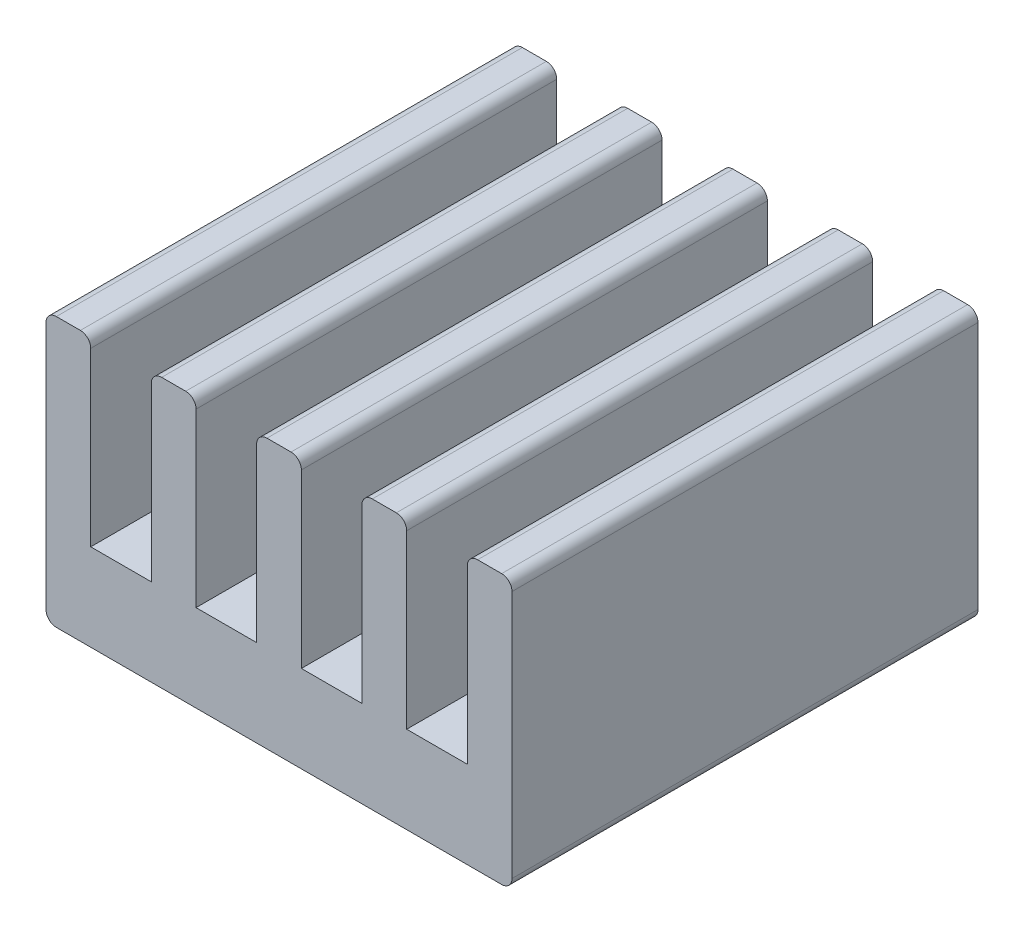
ISO-10303-21;
HEADER;
FILE_DESCRIPTION(('STEP AP214'),'2;1');
FILE_NAME('part.step','',(''),(''),'','','');
FILE_SCHEMA(('AUTOMOTIVE_DESIGN { 1 0 10303 214 1 1 1 1 }'));
ENDSEC;
DATA;
#1=APPLICATION_CONTEXT('core data for automotive mechanical design processes');
#2=APPLICATION_PROTOCOL_DEFINITION('international standard','automotive_design',2000,#1);
#3=PRODUCT_CONTEXT('',#1,'mechanical');
#4=PRODUCT('Part','Part','',(#3));
#5=PRODUCT_RELATED_PRODUCT_CATEGORY('part','',(#4));
#6=PRODUCT_DEFINITION_FORMATION('','',#4);
#7=PRODUCT_DEFINITION_CONTEXT('part definition',#1,'design');
#8=PRODUCT_DEFINITION('design','',#6,#7);
#9=PRODUCT_DEFINITION_SHAPE('','',#8);
#10=(LENGTH_UNIT() NAMED_UNIT(*) SI_UNIT(.MILLI.,.METRE.));
#11=(NAMED_UNIT(*) PLANE_ANGLE_UNIT() SI_UNIT($,.RADIAN.));
#12=(NAMED_UNIT(*) SI_UNIT($,.STERADIAN.) SOLID_ANGLE_UNIT());
#13=UNCERTAINTY_MEASURE_WITH_UNIT(LENGTH_MEASURE(1.E-05),#10,'distance_accuracy_value','');
#14=(GEOMETRIC_REPRESENTATION_CONTEXT(3) GLOBAL_UNCERTAINTY_ASSIGNED_CONTEXT((#13)) GLOBAL_UNIT_ASSIGNED_CONTEXT((#10,
#11,#12)) REPRESENTATION_CONTEXT('',''));
#15=CARTESIAN_POINT('',(0.,0.,0.));
#16=DIRECTION('',(0.,0.,1.));
#17=DIRECTION('',(1.,0.,0.));
#18=AXIS2_PLACEMENT_3D('',#15,#16,#17);
#19=CARTESIAN_POINT('',(0.,5.2,0.));
#20=DIRECTION('',(0.,-1.,0.));
#21=DIRECTION('',(0.,0.,-1.));
#22=AXIS2_PLACEMENT_3D('',#19,#20,#21);
#23=PLANE('',#22);
#24=DIRECTION('',(-1.,0.,0.));
#25=VECTOR('',#24,1.);
#26=CARTESIAN_POINT('',(-4.5,5.2,-4.5));
#27=LINE('',#26,#25);
#28=CARTESIAN_POINT('',(-1.802,5.2,-4.5));
#29=VERTEX_POINT('',#28);
#30=CARTESIAN_POINT('',(-2.266,5.2,-4.5));
#31=VERTEX_POINT('',#30);
#32=EDGE_CURVE('E347',#29,#31,#27,.T.);
#33=ORIENTED_EDGE('',*,*,#32,.T.);
#34=DIRECTION('',(0.,0.,1.));
#35=VECTOR('',#34,1.);
#36=CARTESIAN_POINT('',(-2.266,5.2,0.));
#37=LINE('',#36,#35);
#38=CARTESIAN_POINT('',(-2.266,5.2,4.5));
#39=VERTEX_POINT('',#38);
#40=EDGE_CURVE('E441',#31,#39,#37,.T.);
#41=ORIENTED_EDGE('',*,*,#40,.T.);
#42=DIRECTION('',(1.,0.,0.));
#43=VECTOR('',#42,1.);
#44=CARTESIAN_POINT('',(-4.5,5.2,4.5));
#45=LINE('',#44,#43);
#46=CARTESIAN_POINT('',(-1.802,5.2,4.5));
#47=VERTEX_POINT('',#46);
#48=EDGE_CURVE('E353',#39,#47,#45,.T.);
#49=ORIENTED_EDGE('',*,*,#48,.T.);
#50=DIRECTION('',(0.,0.,1.));
#51=VECTOR('',#50,1.);
#52=CARTESIAN_POINT('',(-1.802,5.2,0.));
#53=LINE('',#52,#51);
#54=EDGE_CURVE('E439',#47,#29,#53,.F.);
#55=ORIENTED_EDGE('',*,*,#54,.T.);
#56=EDGE_LOOP('',(#33,#41,#49,#55));
#57=FACE_BOUND('',#56,.T.);
#58=ADVANCED_FACE('F35',(#57),#23,.F.);
#59=CARTESIAN_POINT('',(2.266,5.2,-4.5));
#60=VERTEX_POINT('',#59);
#61=CARTESIAN_POINT('',(1.802,5.2,-4.5));
#62=VERTEX_POINT('',#61);
#63=EDGE_CURVE('E487',#60,#62,#27,.T.);
#64=ORIENTED_EDGE('',*,*,#63,.T.);
#65=DIRECTION('',(0.,0.,1.));
#66=VECTOR('',#65,1.);
#67=CARTESIAN_POINT('',(1.802,5.2,0.));
#68=LINE('',#67,#66);
#69=CARTESIAN_POINT('',(1.802,5.2,4.5));
#70=VERTEX_POINT('',#69);
#71=EDGE_CURVE('E459',#62,#70,#68,.T.);
#72=ORIENTED_EDGE('',*,*,#71,.T.);
#73=CARTESIAN_POINT('',(2.266,5.2,4.5));
#74=VERTEX_POINT('',#73);
#75=EDGE_CURVE('E354',#70,#74,#45,.T.);
#76=ORIENTED_EDGE('',*,*,#75,.T.);
#77=DIRECTION('',(0.,0.,1.));
#78=VECTOR('',#77,1.);
#79=CARTESIAN_POINT('',(2.266,5.2,0.));
#80=LINE('',#79,#78);
#81=EDGE_CURVE('E457',#74,#60,#80,.F.);
#82=ORIENTED_EDGE('',*,*,#81,.T.);
#83=EDGE_LOOP('',(#64,#72,#76,#82));
#84=FACE_BOUND('',#83,.T.);
#85=ADVANCED_FACE('F583',(#84),#23,.F.);
#86=CARTESIAN_POINT('',(0.232000000000002,5.2,-4.5));
#87=VERTEX_POINT('',#86);
#88=CARTESIAN_POINT('',(-0.231999999999999,5.2,-4.5));
#89=VERTEX_POINT('',#88);
#90=EDGE_CURVE('E511',#87,#89,#27,.T.);
#91=ORIENTED_EDGE('',*,*,#90,.T.);
#92=DIRECTION('',(0.,0.,1.));
#93=VECTOR('',#92,1.);
#94=CARTESIAN_POINT('',(-0.231999999999999,5.2,0.));
#95=LINE('',#94,#93);
#96=CARTESIAN_POINT('',(-0.231999999999999,5.2,4.5));
#97=VERTEX_POINT('',#96);
#98=EDGE_CURVE('E449',#89,#97,#95,.T.);
#99=ORIENTED_EDGE('',*,*,#98,.T.);
#100=CARTESIAN_POINT('',(0.232000000000002,5.2,4.5));
#101=VERTEX_POINT('',#100);
#102=EDGE_CURVE('E350',#97,#101,#45,.T.);
#103=ORIENTED_EDGE('',*,*,#102,.T.);
#104=DIRECTION('',(0.,0.,1.));
#105=VECTOR('',#104,1.);
#106=CARTESIAN_POINT('',(0.232000000000002,5.2,0.));
#107=LINE('',#106,#105);
#108=EDGE_CURVE('E447',#101,#87,#107,.F.);
#109=ORIENTED_EDGE('',*,*,#108,.T.);
#110=EDGE_LOOP('',(#91,#99,#103,#109));
#111=FACE_BOUND('',#110,.T.);
#112=ADVANCED_FACE('F514',(#111),#23,.F.);
#113=CARTESIAN_POINT('',(-3.836,5.2,-4.5));
#114=VERTEX_POINT('',#113);
#115=CARTESIAN_POINT('',(-4.3,5.2,-4.5));
#116=VERTEX_POINT('',#115);
#117=EDGE_CURVE('E344',#114,#116,#27,.T.);
#118=ORIENTED_EDGE('',*,*,#117,.T.);
#119=DIRECTION('',(0.,0.,1.));
#120=VECTOR('',#119,1.);
#121=CARTESIAN_POINT('',(-4.3,5.2,0.));
#122=LINE('',#121,#120);
#123=CARTESIAN_POINT('',(-4.3,5.2,4.5));
#124=VERTEX_POINT('',#123);
#125=EDGE_CURVE('E433',#116,#124,#122,.T.);
#126=ORIENTED_EDGE('',*,*,#125,.T.);
#127=CARTESIAN_POINT('',(-3.836,5.2,4.5));
#128=VERTEX_POINT('',#127);
#129=EDGE_CURVE('E362',#124,#128,#45,.T.);
#130=ORIENTED_EDGE('',*,*,#129,.T.);
#131=DIRECTION('',(0.,0.,1.));
#132=VECTOR('',#131,1.);
#133=CARTESIAN_POINT('',(-3.836,5.2,0.));
#134=LINE('',#133,#132);
#135=EDGE_CURVE('E431',#128,#114,#134,.F.);
#136=ORIENTED_EDGE('',*,*,#135,.T.);
#137=EDGE_LOOP('',(#118,#126,#130,#136));
#138=FACE_BOUND('',#137,.T.);
#139=ADVANCED_FACE('F533',(#138),#23,.F.);
#140=CARTESIAN_POINT('',(4.5,5.2,4.5));
#141=DIRECTION('',(-1.,0.,0.));
#142=DIRECTION('',(0.,0.,1.));
#143=AXIS2_PLACEMENT_3D('',#140,#141,#142);
#144=PLANE('',#143);
#145=DIRECTION('',(0.,-1.,0.));
#146=VECTOR('',#145,1.);
#147=CARTESIAN_POINT('',(4.5,5.2,4.5));
#148=LINE('',#147,#146);
#149=CARTESIAN_POINT('',(4.5,5.,4.5));
#150=VERTEX_POINT('',#149);
#151=CARTESIAN_POINT('',(4.5,0.2,4.5));
#152=VERTEX_POINT('',#151);
#153=EDGE_CURVE('E358',#150,#152,#148,.T.);
#154=ORIENTED_EDGE('',*,*,#153,.T.);
#155=DIRECTION('',(0.,0.,-1.));
#156=VECTOR('',#155,1.);
#157=CARTESIAN_POINT('',(4.5,0.2,-4.5));
#158=LINE('',#157,#156);
#159=CARTESIAN_POINT('',(4.5,0.2,-4.5));
#160=VERTEX_POINT('',#159);
#161=EDGE_CURVE('E428',#152,#160,#158,.T.);
#162=ORIENTED_EDGE('',*,*,#161,.T.);
#163=DIRECTION('',(0.,-1.,0.));
#164=VECTOR('',#163,1.);
#165=CARTESIAN_POINT('',(4.5,5.2,-4.5));
#166=LINE('',#165,#164);
#167=CARTESIAN_POINT('',(4.5,5.,-4.5));
#168=VERTEX_POINT('',#167);
#169=EDGE_CURVE('E368',#168,#160,#166,.T.);
#170=ORIENTED_EDGE('',*,*,#169,.F.);
#171=DIRECTION('',(0.,0.,-1.));
#172=VECTOR('',#171,1.);
#173=CARTESIAN_POINT('',(4.5,5.,4.5));
#174=LINE('',#173,#172);
#175=EDGE_CURVE('E426',#168,#150,#174,.F.);
#176=ORIENTED_EDGE('',*,*,#175,.T.);
#177=EDGE_LOOP('',(#154,#162,#170,#176));
#178=FACE_BOUND('',#177,.T.);
#179=ADVANCED_FACE('F558',(#178),#144,.F.);
#180=CARTESIAN_POINT('',(-4.5,5.2,-4.5));
#181=DIRECTION('',(0.,0.,1.));
#182=DIRECTION('',(1.,0.,0.));
#183=AXIS2_PLACEMENT_3D('',#180,#181,#182);
#184=PLANE('',#183);
#185=DIRECTION('',(-1.,0.,0.));
#186=VECTOR('',#185,1.);
#187=CARTESIAN_POINT('',(-4.5,0.,-4.5));
#188=LINE('',#187,#186);
#189=CARTESIAN_POINT('',(4.3,0.,-4.5));
#190=VERTEX_POINT('',#189);
#191=CARTESIAN_POINT('',(-4.3,0.,-4.5));
#192=VERTEX_POINT('',#191);
#193=EDGE_CURVE('E341',#190,#192,#188,.T.);
#194=ORIENTED_EDGE('',*,*,#193,.T.);
#195=CARTESIAN_POINT('',(-4.3,0.2,-4.5));
#196=DIRECTION('',(0.,0.,1.));
#197=DIRECTION('',(1.,0.,0.));
#198=AXIS2_PLACEMENT_3D('',#195,#196,#197);
#199=CIRCLE('',#198,0.2);
#200=CARTESIAN_POINT('',(-4.5,0.2,-4.5));
#201=VERTEX_POINT('',#200);
#202=EDGE_CURVE('E424',#192,#201,#199,.F.);
#203=ORIENTED_EDGE('',*,*,#202,.T.);
#204=DIRECTION('',(0.,-1.,0.));
#205=VECTOR('',#204,1.);
#206=CARTESIAN_POINT('',(-4.5,5.2,-4.5));
#207=LINE('',#206,#205);
#208=CARTESIAN_POINT('',(-4.5,5.,-4.5));
#209=VERTEX_POINT('',#208);
#210=EDGE_CURVE('E365',#209,#201,#207,.T.);
#211=ORIENTED_EDGE('',*,*,#210,.F.);
#212=CARTESIAN_POINT('',(-4.3,5.,-4.5));
#213=DIRECTION('',(0.,0.,1.));
#214=DIRECTION('',(1.,0.,0.));
#215=AXIS2_PLACEMENT_3D('',#212,#213,#214);
#216=CIRCLE('',#215,0.2);
#217=EDGE_CURVE('E420',#209,#116,#216,.F.);
#218=ORIENTED_EDGE('',*,*,#217,.T.);
#219=ORIENTED_EDGE('',*,*,#117,.F.);
#220=CARTESIAN_POINT('',(-3.836,5.,-4.5));
#221=DIRECTION('',(0.,0.,1.));
#222=DIRECTION('',(1.,0.,0.));
#223=AXIS2_PLACEMENT_3D('',#220,#221,#222);
#224=CIRCLE('',#223,0.2);
#225=CARTESIAN_POINT('',(-3.636,5.,-4.5));
#226=VERTEX_POINT('',#225);
#227=EDGE_CURVE('E58',#114,#226,#224,.F.);
#228=ORIENTED_EDGE('',*,*,#227,.T.);
#229=DIRECTION('',(0.,-1.,0.));
#230=VECTOR('',#229,1.);
#231=CARTESIAN_POINT('',(-3.636,5.2,-4.5));
#232=LINE('',#231,#230);
#233=CARTESIAN_POINT('',(-3.636,1.68,-4.5));
#234=VERTEX_POINT('',#233);
#235=EDGE_CURVE('E325',#226,#234,#232,.T.);
#236=ORIENTED_EDGE('',*,*,#235,.T.);
#237=DIRECTION('',(1.,0.,0.));
#238=VECTOR('',#237,1.);
#239=CARTESIAN_POINT('',(-3.636,1.68,-4.5));
#240=LINE('',#239,#238);
#241=CARTESIAN_POINT('',(-2.466,1.68,-4.5));
#242=VERTEX_POINT('',#241);
#243=EDGE_CURVE('E327',#234,#242,#240,.T.);
#244=ORIENTED_EDGE('',*,*,#243,.T.);
#245=DIRECTION('',(0.,1.,0.));
#246=VECTOR('',#245,1.);
#247=CARTESIAN_POINT('',(-2.466,5.2,-4.5));
#248=LINE('',#247,#246);
#249=CARTESIAN_POINT('',(-2.466,5.,-4.5));
#250=VERTEX_POINT('',#249);
#251=EDGE_CURVE('E331',#242,#250,#248,.T.);
#252=ORIENTED_EDGE('',*,*,#251,.T.);
#253=CARTESIAN_POINT('',(-2.266,5.,-4.5));
#254=DIRECTION('',(0.,0.,1.));
#255=DIRECTION('',(1.,0.,0.));
#256=AXIS2_PLACEMENT_3D('',#253,#254,#255);
#257=CIRCLE('',#256,0.2);
#258=EDGE_CURVE('E417',#250,#31,#257,.F.);
#259=ORIENTED_EDGE('',*,*,#258,.T.);
#260=ORIENTED_EDGE('',*,*,#32,.F.);
#261=CARTESIAN_POINT('',(-1.802,5.,-4.5));
#262=DIRECTION('',(0.,0.,1.));
#263=DIRECTION('',(1.,0.,0.));
#264=AXIS2_PLACEMENT_3D('',#261,#262,#263);
#265=CIRCLE('',#264,0.2);
#266=CARTESIAN_POINT('',(-1.602,5.,-4.5));
#267=VERTEX_POINT('',#266);
#268=EDGE_CURVE('E254',#29,#267,#265,.F.);
#269=ORIENTED_EDGE('',*,*,#268,.T.);
#270=DIRECTION('',(0.,-1.,0.));
#271=VECTOR('',#270,1.);
#272=CARTESIAN_POINT('',(-1.602,5.2,-4.5));
#273=LINE('',#272,#271);
#274=CARTESIAN_POINT('',(-1.602,1.68,-4.5));
#275=VERTEX_POINT('',#274);
#276=EDGE_CURVE('E245',#267,#275,#273,.T.);
#277=ORIENTED_EDGE('',*,*,#276,.T.);
#278=DIRECTION('',(1.,0.,0.));
#279=VECTOR('',#278,1.);
#280=CARTESIAN_POINT('',(-1.602,1.68,-4.5));
#281=LINE('',#280,#279);
#282=CARTESIAN_POINT('',(-0.431999999999998,1.68,-4.5));
#283=VERTEX_POINT('',#282);
#284=EDGE_CURVE('E251',#275,#283,#281,.T.);
#285=ORIENTED_EDGE('',*,*,#284,.T.);
#286=DIRECTION('',(0.,1.,0.));
#287=VECTOR('',#286,1.);
#288=CARTESIAN_POINT('',(-0.431999999999999,5.2,-4.5));
#289=LINE('',#288,#287);
#290=CARTESIAN_POINT('',(-0.431999999999999,5.,-4.5));
#291=VERTEX_POINT('',#290);
#292=EDGE_CURVE('E269',#283,#291,#289,.T.);
#293=ORIENTED_EDGE('',*,*,#292,.T.);
#294=CARTESIAN_POINT('',(-0.231999999999999,5.,-4.5));
#295=DIRECTION('',(0.,0.,1.));
#296=DIRECTION('',(1.,0.,0.));
#297=AXIS2_PLACEMENT_3D('',#294,#295,#296);
#298=CIRCLE('',#297,0.2);
#299=EDGE_CURVE('E414',#291,#89,#298,.F.);
#300=ORIENTED_EDGE('',*,*,#299,.T.);
#301=ORIENTED_EDGE('',*,*,#90,.F.);
#302=CARTESIAN_POINT('',(0.232000000000002,5.,-4.5));
#303=DIRECTION('',(0.,0.,1.));
#304=DIRECTION('',(1.,0.,0.));
#305=AXIS2_PLACEMENT_3D('',#302,#303,#304);
#306=CIRCLE('',#305,0.2);
#307=CARTESIAN_POINT('',(0.432000000000002,5.,-4.5));
#308=VERTEX_POINT('',#307);
#309=EDGE_CURVE('E412',#87,#308,#306,.F.);
#310=ORIENTED_EDGE('',*,*,#309,.T.);
#311=DIRECTION('',(0.,-1.,0.));
#312=VECTOR('',#311,1.);
#313=CARTESIAN_POINT('',(0.432000000000002,5.2,-4.5));
#314=LINE('',#313,#312);
#315=CARTESIAN_POINT('',(0.432000000000002,1.68,-4.5));
#316=VERTEX_POINT('',#315);
#317=EDGE_CURVE('E304',#308,#316,#314,.T.);
#318=ORIENTED_EDGE('',*,*,#317,.T.);
#319=DIRECTION('',(1.,0.,0.));
#320=VECTOR('',#319,1.);
#321=CARTESIAN_POINT('',(0.432000000000002,1.68,-4.5));
#322=LINE('',#321,#320);
#323=CARTESIAN_POINT('',(1.602,1.68,-4.5));
#324=VERTEX_POINT('',#323);
#325=EDGE_CURVE('E306',#316,#324,#322,.T.);
#326=ORIENTED_EDGE('',*,*,#325,.T.);
#327=DIRECTION('',(0.,1.,0.));
#328=VECTOR('',#327,1.);
#329=CARTESIAN_POINT('',(1.602,5.2,-4.5));
#330=LINE('',#329,#328);
#331=CARTESIAN_POINT('',(1.602,5.,-4.5));
#332=VERTEX_POINT('',#331);
#333=EDGE_CURVE('E310',#324,#332,#330,.T.);
#334=ORIENTED_EDGE('',*,*,#333,.T.);
#335=CARTESIAN_POINT('',(1.802,5.,-4.5));
#336=DIRECTION('',(0.,0.,1.));
#337=DIRECTION('',(1.,0.,0.));
#338=AXIS2_PLACEMENT_3D('',#335,#336,#337);
#339=CIRCLE('',#338,0.2);
#340=EDGE_CURVE('E410',#332,#62,#339,.F.);
#341=ORIENTED_EDGE('',*,*,#340,.T.);
#342=ORIENTED_EDGE('',*,*,#63,.F.);
#343=CARTESIAN_POINT('',(2.266,5.,-4.5));
#344=DIRECTION('',(0.,0.,1.));
#345=DIRECTION('',(1.,0.,0.));
#346=AXIS2_PLACEMENT_3D('',#343,#344,#345);
#347=CIRCLE('',#346,0.2);
#348=CARTESIAN_POINT('',(2.466,5.,-4.5));
#349=VERTEX_POINT('',#348);
#350=EDGE_CURVE('E408',#60,#349,#347,.F.);
#351=ORIENTED_EDGE('',*,*,#350,.T.);
#352=DIRECTION('',(0.,-1.,0.));
#353=VECTOR('',#352,1.);
#354=CARTESIAN_POINT('',(2.466,5.2,-4.5));
#355=LINE('',#354,#353);
#356=CARTESIAN_POINT('',(2.466,1.68,-4.5));
#357=VERTEX_POINT('',#356);
#358=EDGE_CURVE('E283',#349,#357,#355,.T.);
#359=ORIENTED_EDGE('',*,*,#358,.T.);
#360=DIRECTION('',(1.,0.,0.));
#361=VECTOR('',#360,1.);
#362=CARTESIAN_POINT('',(2.466,1.68,-4.5));
#363=LINE('',#362,#361);
#364=CARTESIAN_POINT('',(3.636,1.68,-4.5));
#365=VERTEX_POINT('',#364);
#366=EDGE_CURVE('E285',#357,#365,#363,.T.);
#367=ORIENTED_EDGE('',*,*,#366,.T.);
#368=DIRECTION('',(0.,1.,0.));
#369=VECTOR('',#368,1.);
#370=CARTESIAN_POINT('',(3.636,5.2,-4.5));
#371=LINE('',#370,#369);
#372=CARTESIAN_POINT('',(3.636,5.,-4.5));
#373=VERTEX_POINT('',#372);
#374=EDGE_CURVE('E289',#365,#373,#371,.T.);
#375=ORIENTED_EDGE('',*,*,#374,.T.);
#376=CARTESIAN_POINT('',(3.836,5.,-4.5));
#377=DIRECTION('',(0.,0.,1.));
#378=DIRECTION('',(1.,0.,0.));
#379=AXIS2_PLACEMENT_3D('',#376,#377,#378);
#380=CIRCLE('',#379,0.2);
#381=CARTESIAN_POINT('',(3.836,5.2,-4.5));
#382=VERTEX_POINT('',#381);
#383=EDGE_CURVE('E406',#373,#382,#380,.F.);
#384=ORIENTED_EDGE('',*,*,#383,.T.);
#385=CARTESIAN_POINT('',(4.3,5.2,-4.5));
#386=VERTEX_POINT('',#385);
#387=EDGE_CURVE('E349',#386,#382,#27,.T.);
#388=ORIENTED_EDGE('',*,*,#387,.F.);
#389=CARTESIAN_POINT('',(4.3,5.,-4.5));
#390=DIRECTION('',(0.,0.,1.));
#391=DIRECTION('',(1.,0.,0.));
#392=AXIS2_PLACEMENT_3D('',#389,#390,#391);
#393=CIRCLE('',#392,0.2);
#394=EDGE_CURVE('E404',#386,#168,#393,.F.);
#395=ORIENTED_EDGE('',*,*,#394,.T.);
#396=ORIENTED_EDGE('',*,*,#169,.T.);
#397=CARTESIAN_POINT('',(4.3,0.2,-4.5));
#398=DIRECTION('',(0.,0.,1.));
#399=DIRECTION('',(1.,0.,0.));
#400=AXIS2_PLACEMENT_3D('',#397,#398,#399);
#401=CIRCLE('',#400,0.2);
#402=EDGE_CURVE('E422',#160,#190,#401,.F.);
#403=ORIENTED_EDGE('',*,*,#402,.T.);
#404=EDGE_LOOP('',(#194,#203,#211,#218,#219,#228,#236,#244,#252,#259,#260,#269,#277,#285,#293,
#300,#301,#310,#318,#326,#334,#341,#342,#351,#359,#367,#375,#384,#388,#395,#396,#403));
#405=FACE_BOUND('',#404,.T.);
#406=ADVANCED_FACE('F248',(#405),#184,.F.);
#407=CARTESIAN_POINT('',(-4.5,5.2,4.5));
#408=DIRECTION('',(1.,0.,0.));
#409=DIRECTION('',(0.,0.,-1.));
#410=AXIS2_PLACEMENT_3D('',#407,#408,#409);
#411=PLANE('',#410);
#412=ORIENTED_EDGE('',*,*,#210,.T.);
#413=DIRECTION('',(0.,0.,1.));
#414=VECTOR('',#413,1.);
#415=CARTESIAN_POINT('',(-4.5,0.2,4.5));
#416=LINE('',#415,#414);
#417=CARTESIAN_POINT('',(-4.5,0.2,4.5));
#418=VERTEX_POINT('',#417);
#419=EDGE_CURVE('E373',#201,#418,#416,.T.);
#420=ORIENTED_EDGE('',*,*,#419,.T.);
#421=DIRECTION('',(0.,-1.,0.));
#422=VECTOR('',#421,1.);
#423=CARTESIAN_POINT('',(-4.5,5.2,4.5));
#424=LINE('',#423,#422);
#425=CARTESIAN_POINT('',(-4.5,5.,4.5));
#426=VERTEX_POINT('',#425);
#427=EDGE_CURVE('E361',#426,#418,#424,.T.);
#428=ORIENTED_EDGE('',*,*,#427,.F.);
#429=DIRECTION('',(0.,0.,1.));
#430=VECTOR('',#429,1.);
#431=CARTESIAN_POINT('',(-4.5,5.,4.5));
#432=LINE('',#431,#430);
#433=EDGE_CURVE('E371',#426,#209,#432,.F.);
#434=ORIENTED_EDGE('',*,*,#433,.T.);
#435=EDGE_LOOP('',(#412,#420,#428,#434));
#436=FACE_BOUND('',#435,.T.);
#437=ADVANCED_FACE('F542',(#436),#411,.F.);
#438=CARTESIAN_POINT('',(-4.5,5.2,4.5));
#439=DIRECTION('',(0.,0.,-1.));
#440=DIRECTION('',(-1.,0.,0.));
#441=AXIS2_PLACEMENT_3D('',#438,#439,#440);
#442=PLANE('',#441);
#443=ORIENTED_EDGE('',*,*,#427,.T.);
#444=CARTESIAN_POINT('',(-4.3,0.2,4.5));
#445=DIRECTION('',(0.,0.,-1.));
#446=DIRECTION('',(-1.,0.,0.));
#447=AXIS2_PLACEMENT_3D('',#444,#445,#446);
#448=CIRCLE('',#447,0.2);
#449=CARTESIAN_POINT('',(-4.3,0.,4.5));
#450=VERTEX_POINT('',#449);
#451=EDGE_CURVE('E398',#418,#450,#448,.F.);
#452=ORIENTED_EDGE('',*,*,#451,.T.);
#453=DIRECTION('',(1.,0.,0.));
#454=VECTOR('',#453,1.);
#455=CARTESIAN_POINT('',(-4.5,0.,4.5));
#456=LINE('',#455,#454);
#457=CARTESIAN_POINT('',(4.3,0.,4.5));
#458=VERTEX_POINT('',#457);
#459=EDGE_CURVE('E348',#450,#458,#456,.T.);
#460=ORIENTED_EDGE('',*,*,#459,.T.);
#461=CARTESIAN_POINT('',(4.3,0.2,4.5));
#462=DIRECTION('',(0.,0.,-1.));
#463=DIRECTION('',(-1.,0.,0.));
#464=AXIS2_PLACEMENT_3D('',#461,#462,#463);
#465=CIRCLE('',#464,0.2);
#466=EDGE_CURVE('E396',#458,#152,#465,.F.);
#467=ORIENTED_EDGE('',*,*,#466,.T.);
#468=ORIENTED_EDGE('',*,*,#153,.F.);
#469=CARTESIAN_POINT('',(4.3,5.,4.5));
#470=DIRECTION('',(0.,0.,-1.));
#471=DIRECTION('',(-1.,0.,0.));
#472=AXIS2_PLACEMENT_3D('',#469,#470,#471);
#473=CIRCLE('',#472,0.2);
#474=CARTESIAN_POINT('',(4.3,5.2,4.5));
#475=VERTEX_POINT('',#474);
#476=EDGE_CURVE('E376',#150,#475,#473,.F.);
#477=ORIENTED_EDGE('',*,*,#476,.T.);
#478=CARTESIAN_POINT('',(3.836,5.2,4.5));
#479=VERTEX_POINT('',#478);
#480=EDGE_CURVE('E476',#479,#475,#45,.T.);
#481=ORIENTED_EDGE('',*,*,#480,.F.);
#482=CARTESIAN_POINT('',(3.836,5.,4.5));
#483=DIRECTION('',(0.,0.,-1.));
#484=DIRECTION('',(-1.,0.,0.));
#485=AXIS2_PLACEMENT_3D('',#482,#483,#484);
#486=CIRCLE('',#485,0.2);
#487=CARTESIAN_POINT('',(3.636,5.,4.5));
#488=VERTEX_POINT('',#487);
#489=EDGE_CURVE('E378',#479,#488,#486,.F.);
#490=ORIENTED_EDGE('',*,*,#489,.T.);
#491=DIRECTION('',(0.,1.,0.));
#492=VECTOR('',#491,1.);
#493=CARTESIAN_POINT('',(3.636,5.2,4.5));
#494=LINE('',#493,#492);
#495=CARTESIAN_POINT('',(3.636,1.68,4.5));
#496=VERTEX_POINT('',#495);
#497=EDGE_CURVE('E286',#496,#488,#494,.T.);
#498=ORIENTED_EDGE('',*,*,#497,.F.);
#499=DIRECTION('',(1.,0.,0.));
#500=VECTOR('',#499,1.);
#501=CARTESIAN_POINT('',(2.466,1.68,4.5));
#502=LINE('',#501,#500);
#503=CARTESIAN_POINT('',(2.466,1.68,4.5));
#504=VERTEX_POINT('',#503);
#505=EDGE_CURVE('E294',#504,#496,#502,.T.);
#506=ORIENTED_EDGE('',*,*,#505,.F.);
#507=DIRECTION('',(0.,-1.,0.));
#508=VECTOR('',#507,1.);
#509=CARTESIAN_POINT('',(2.466,5.2,4.5));
#510=LINE('',#509,#508);
#511=CARTESIAN_POINT('',(2.466,5.,4.5));
#512=VERTEX_POINT('',#511);
#513=EDGE_CURVE('E281',#512,#504,#510,.T.);
#514=ORIENTED_EDGE('',*,*,#513,.F.);
#515=CARTESIAN_POINT('',(2.266,5.,4.5));
#516=DIRECTION('',(0.,0.,-1.));
#517=DIRECTION('',(-1.,0.,0.));
#518=AXIS2_PLACEMENT_3D('',#515,#516,#517);
#519=CIRCLE('',#518,0.2);
#520=EDGE_CURVE('E380',#512,#74,#519,.F.);
#521=ORIENTED_EDGE('',*,*,#520,.T.);
#522=ORIENTED_EDGE('',*,*,#75,.F.);
#523=CARTESIAN_POINT('',(1.802,5.,4.5));
#524=DIRECTION('',(0.,0.,-1.));
#525=DIRECTION('',(-1.,0.,0.));
#526=AXIS2_PLACEMENT_3D('',#523,#524,#525);
#527=CIRCLE('',#526,0.2);
#528=CARTESIAN_POINT('',(1.602,5.,4.5));
#529=VERTEX_POINT('',#528);
#530=EDGE_CURVE('E382',#70,#529,#527,.F.);
#531=ORIENTED_EDGE('',*,*,#530,.T.);
#532=DIRECTION('',(0.,1.,0.));
#533=VECTOR('',#532,1.);
#534=CARTESIAN_POINT('',(1.602,5.2,4.5));
#535=LINE('',#534,#533);
#536=CARTESIAN_POINT('',(1.602,1.68,4.5));
#537=VERTEX_POINT('',#536);
#538=EDGE_CURVE('E307',#537,#529,#535,.T.);
#539=ORIENTED_EDGE('',*,*,#538,.F.);
#540=DIRECTION('',(1.,0.,0.));
#541=VECTOR('',#540,1.);
#542=CARTESIAN_POINT('',(0.432000000000002,1.68,4.5));
#543=LINE('',#542,#541);
#544=CARTESIAN_POINT('',(0.432000000000002,1.68,4.5));
#545=VERTEX_POINT('',#544);
#546=EDGE_CURVE('E315',#545,#537,#543,.T.);
#547=ORIENTED_EDGE('',*,*,#546,.F.);
#548=DIRECTION('',(0.,-1.,0.));
#549=VECTOR('',#548,1.);
#550=CARTESIAN_POINT('',(0.432000000000002,5.2,4.5));
#551=LINE('',#550,#549);
#552=CARTESIAN_POINT('',(0.432000000000002,5.,4.5));
#553=VERTEX_POINT('',#552);
#554=EDGE_CURVE('E301',#553,#545,#551,.T.);
#555=ORIENTED_EDGE('',*,*,#554,.F.);
#556=CARTESIAN_POINT('',(0.232000000000002,5.,4.5));
#557=DIRECTION('',(0.,0.,-1.));
#558=DIRECTION('',(-1.,0.,0.));
#559=AXIS2_PLACEMENT_3D('',#556,#557,#558);
#560=CIRCLE('',#559,0.2);
#561=EDGE_CURVE('E384',#553,#101,#560,.F.);
#562=ORIENTED_EDGE('',*,*,#561,.T.);
#563=ORIENTED_EDGE('',*,*,#102,.F.);
#564=CARTESIAN_POINT('',(-0.231999999999999,5.,4.5));
#565=DIRECTION('',(0.,0.,-1.));
#566=DIRECTION('',(-1.,0.,0.));
#567=AXIS2_PLACEMENT_3D('',#564,#565,#566);
#568=CIRCLE('',#567,0.2);
#569=CARTESIAN_POINT('',(-0.431999999999999,5.,4.5));
#570=VERTEX_POINT('',#569);
#571=EDGE_CURVE('E386',#97,#570,#568,.F.);
#572=ORIENTED_EDGE('',*,*,#571,.T.);
#573=DIRECTION('',(0.,1.,0.));
#574=VECTOR('',#573,1.);
#575=CARTESIAN_POINT('',(-0.431999999999999,5.2,4.5));
#576=LINE('',#575,#574);
#577=CARTESIAN_POINT('',(-0.431999999999998,1.68,4.5));
#578=VERTEX_POINT('',#577);
#579=EDGE_CURVE('E258',#578,#570,#576,.T.);
#580=ORIENTED_EDGE('',*,*,#579,.F.);
#581=DIRECTION('',(1.,0.,0.));
#582=VECTOR('',#581,1.);
#583=CARTESIAN_POINT('',(-1.602,1.68,4.5));
#584=LINE('',#583,#582);
#585=CARTESIAN_POINT('',(-1.602,1.68,4.5));
#586=VERTEX_POINT('',#585);
#587=EDGE_CURVE('E277',#586,#578,#584,.T.);
#588=ORIENTED_EDGE('',*,*,#587,.F.);
#589=DIRECTION('',(0.,-1.,0.));
#590=VECTOR('',#589,1.);
#591=CARTESIAN_POINT('',(-1.602,5.2,4.5));
#592=LINE('',#591,#590);
#593=CARTESIAN_POINT('',(-1.602,5.,4.5));
#594=VERTEX_POINT('',#593);
#595=EDGE_CURVE('E264',#594,#586,#592,.T.);
#596=ORIENTED_EDGE('',*,*,#595,.F.);
#597=CARTESIAN_POINT('',(-1.802,5.,4.5));
#598=DIRECTION('',(0.,0.,-1.));
#599=DIRECTION('',(-1.,0.,0.));
#600=AXIS2_PLACEMENT_3D('',#597,#598,#599);
#601=CIRCLE('',#600,0.2);
#602=EDGE_CURVE('E388',#594,#47,#601,.F.);
#603=ORIENTED_EDGE('',*,*,#602,.T.);
#604=ORIENTED_EDGE('',*,*,#48,.F.);
#605=CARTESIAN_POINT('',(-2.266,5.,4.5));
#606=DIRECTION('',(0.,0.,-1.));
#607=DIRECTION('',(-1.,0.,0.));
#608=AXIS2_PLACEMENT_3D('',#605,#606,#607);
#609=CIRCLE('',#608,0.2);
#610=CARTESIAN_POINT('',(-2.466,5.,4.5));
#611=VERTEX_POINT('',#610);
#612=EDGE_CURVE('E390',#39,#611,#609,.F.);
#613=ORIENTED_EDGE('',*,*,#612,.T.);
#614=DIRECTION('',(0.,1.,0.));
#615=VECTOR('',#614,1.);
#616=CARTESIAN_POINT('',(-2.466,5.2,4.5));
#617=LINE('',#616,#615);
#618=CARTESIAN_POINT('',(-2.466,1.68,4.5));
#619=VERTEX_POINT('',#618);
#620=EDGE_CURVE('E328',#619,#611,#617,.T.);
#621=ORIENTED_EDGE('',*,*,#620,.F.);
#622=DIRECTION('',(1.,0.,0.));
#623=VECTOR('',#622,1.);
#624=CARTESIAN_POINT('',(-3.636,1.68,4.5));
#625=LINE('',#624,#623);
#626=CARTESIAN_POINT('',(-3.636,1.68,4.5));
#627=VERTEX_POINT('',#626);
#628=EDGE_CURVE('E335',#627,#619,#625,.T.);
#629=ORIENTED_EDGE('',*,*,#628,.F.);
#630=DIRECTION('',(0.,-1.,0.));
#631=VECTOR('',#630,1.);
#632=CARTESIAN_POINT('',(-3.636,5.2,4.5));
#633=LINE('',#632,#631);
#634=CARTESIAN_POINT('',(-3.636,5.,4.5));
#635=VERTEX_POINT('',#634);
#636=EDGE_CURVE('E322',#635,#627,#633,.T.);
#637=ORIENTED_EDGE('',*,*,#636,.F.);
#638=CARTESIAN_POINT('',(-3.836,5.,4.5));
#639=DIRECTION('',(0.,0.,-1.));
#640=DIRECTION('',(-1.,0.,0.));
#641=AXIS2_PLACEMENT_3D('',#638,#639,#640);
#642=CIRCLE('',#641,0.2);
#643=EDGE_CURVE('E392',#635,#128,#642,.F.);
#644=ORIENTED_EDGE('',*,*,#643,.T.);
#645=ORIENTED_EDGE('',*,*,#129,.F.);
#646=CARTESIAN_POINT('',(-4.3,5.,4.5));
#647=DIRECTION('',(0.,0.,-1.));
#648=DIRECTION('',(-1.,0.,0.));
#649=AXIS2_PLACEMENT_3D('',#646,#647,#648);
#650=CIRCLE('',#649,0.2);
#651=EDGE_CURVE('E394',#124,#426,#650,.F.);
#652=ORIENTED_EDGE('',*,*,#651,.T.);
#653=EDGE_LOOP('',(#443,#452,#460,#467,#468,#477,#481,#490,#498,#506,#514,#521,#522,#531,#539,
#547,#555,#562,#563,#572,#580,#588,#596,#603,#604,#613,#621,#629,#637,#644,#645,#652));
#654=FACE_BOUND('',#653,.T.);
#655=ADVANCED_FACE('F482',(#654),#442,.F.);
#656=ORIENTED_EDGE('',*,*,#387,.T.);
#657=DIRECTION('',(0.,0.,1.));
#658=VECTOR('',#657,1.);
#659=CARTESIAN_POINT('',(3.836,5.2,0.));
#660=LINE('',#659,#658);
#661=EDGE_CURVE('E43',#382,#479,#660,.T.);
#662=ORIENTED_EDGE('',*,*,#661,.T.);
#663=ORIENTED_EDGE('',*,*,#480,.T.);
#664=DIRECTION('',(0.,0.,-1.));
#665=VECTOR('',#664,1.);
#666=CARTESIAN_POINT('',(4.3,5.2,0.));
#667=LINE('',#666,#665);
#668=EDGE_CURVE('E467',#475,#386,#667,.T.);
#669=ORIENTED_EDGE('',*,*,#668,.T.);
#670=EDGE_LOOP('',(#656,#662,#663,#669));
#671=FACE_BOUND('',#670,.T.);
#672=ADVANCED_FACE('F475',(#671),#23,.F.);
#673=CARTESIAN_POINT('',(0.,0.,0.));
#674=DIRECTION('',(0.,-1.,0.));
#675=DIRECTION('',(0.,0.,-1.));
#676=AXIS2_PLACEMENT_3D('',#673,#674,#675);
#677=PLANE('',#676);
#678=ORIENTED_EDGE('',*,*,#459,.F.);
#679=DIRECTION('',(0.,0.,1.));
#680=VECTOR('',#679,1.);
#681=CARTESIAN_POINT('',(-4.3,0.,-4.5));
#682=LINE('',#681,#680);
#683=EDGE_CURVE('E402',#450,#192,#682,.F.);
#684=ORIENTED_EDGE('',*,*,#683,.T.);
#685=ORIENTED_EDGE('',*,*,#193,.F.);
#686=DIRECTION('',(0.,0.,-1.));
#687=VECTOR('',#686,1.);
#688=CARTESIAN_POINT('',(4.3,0.,4.5));
#689=LINE('',#688,#687);
#690=EDGE_CURVE('E400',#190,#458,#689,.F.);
#691=ORIENTED_EDGE('',*,*,#690,.T.);
#692=EDGE_LOOP('',(#678,#684,#685,#691));
#693=FACE_BOUND('',#692,.T.);
#694=ADVANCED_FACE('F551',(#693),#677,.T.);
#695=CARTESIAN_POINT('',(-3.636,5.2,-4.5));
#696=DIRECTION('',(-1.,0.,0.));
#697=DIRECTION('',(0.,-1.,0.));
#698=AXIS2_PLACEMENT_3D('',#695,#696,#697);
#699=PLANE('',#698);
#700=ORIENTED_EDGE('',*,*,#235,.F.);
#701=DIRECTION('',(0.,0.,1.));
#702=VECTOR('',#701,1.);
#703=CARTESIAN_POINT('',(-3.636,5.,-4.5));
#704=LINE('',#703,#702);
#705=EDGE_CURVE('E436',#226,#635,#704,.T.);
#706=ORIENTED_EDGE('',*,*,#705,.T.);
#707=ORIENTED_EDGE('',*,*,#636,.T.);
#708=DIRECTION('',(0.,0.,1.));
#709=VECTOR('',#708,1.);
#710=CARTESIAN_POINT('',(-3.636,1.68,-4.5));
#711=LINE('',#710,#709);
#712=EDGE_CURVE('E333',#234,#627,#711,.T.);
#713=ORIENTED_EDGE('',*,*,#712,.F.);
#714=EDGE_LOOP('',(#700,#706,#707,#713));
#715=FACE_BOUND('',#714,.T.);
#716=ADVANCED_FACE('F529',(#715),#699,.F.);
#717=CARTESIAN_POINT('',(-2.466,5.2,-4.5));
#718=DIRECTION('',(1.,0.,0.));
#719=DIRECTION('',(0.,1.,0.));
#720=AXIS2_PLACEMENT_3D('',#717,#718,#719);
#721=PLANE('',#720);
#722=ORIENTED_EDGE('',*,*,#620,.T.);
#723=DIRECTION('',(0.,0.,1.));
#724=VECTOR('',#723,1.);
#725=CARTESIAN_POINT('',(-2.466,5.,-4.5));
#726=LINE('',#725,#724);
#727=EDGE_CURVE('E50',#611,#250,#726,.F.);
#728=ORIENTED_EDGE('',*,*,#727,.T.);
#729=ORIENTED_EDGE('',*,*,#251,.F.);
#730=DIRECTION('',(0.,0.,1.));
#731=VECTOR('',#730,1.);
#732=CARTESIAN_POINT('',(-2.466,1.68,-4.5));
#733=LINE('',#732,#731);
#734=EDGE_CURVE('E339',#242,#619,#733,.T.);
#735=ORIENTED_EDGE('',*,*,#734,.T.);
#736=EDGE_LOOP('',(#722,#728,#729,#735));
#737=FACE_BOUND('',#736,.T.);
#738=ADVANCED_FACE('F522',(#737),#721,.F.);
#739=CARTESIAN_POINT('',(-3.636,1.68,-4.5));
#740=DIRECTION('',(0.,-1.,0.));
#741=DIRECTION('',(0.,0.,-1.));
#742=AXIS2_PLACEMENT_3D('',#739,#740,#741);
#743=PLANE('',#742);
#744=ORIENTED_EDGE('',*,*,#628,.T.);
#745=ORIENTED_EDGE('',*,*,#734,.F.);
#746=ORIENTED_EDGE('',*,*,#243,.F.);
#747=ORIENTED_EDGE('',*,*,#712,.T.);
#748=EDGE_LOOP('',(#744,#745,#746,#747));
#749=FACE_BOUND('',#748,.T.);
#750=ADVANCED_FACE('F525',(#749),#743,.F.);
#751=CARTESIAN_POINT('',(0.432000000000002,5.2,-4.5));
#752=DIRECTION('',(-1.,0.,0.));
#753=DIRECTION('',(0.,0.,1.));
#754=AXIS2_PLACEMENT_3D('',#751,#752,#753);
#755=PLANE('',#754);
#756=ORIENTED_EDGE('',*,*,#317,.F.);
#757=DIRECTION('',(0.,0.,1.));
#758=VECTOR('',#757,1.);
#759=CARTESIAN_POINT('',(0.432000000000002,5.,-4.5));
#760=LINE('',#759,#758);
#761=EDGE_CURVE('E454',#308,#553,#760,.T.);
#762=ORIENTED_EDGE('',*,*,#761,.T.);
#763=ORIENTED_EDGE('',*,*,#554,.T.);
#764=DIRECTION('',(0.,0.,1.));
#765=VECTOR('',#764,1.);
#766=CARTESIAN_POINT('',(0.432000000000002,1.68,-4.5));
#767=LINE('',#766,#765);
#768=EDGE_CURVE('E313',#316,#545,#767,.T.);
#769=ORIENTED_EDGE('',*,*,#768,.F.);
#770=EDGE_LOOP('',(#756,#762,#763,#769));
#771=FACE_BOUND('',#770,.T.);
#772=ADVANCED_FACE('F602',(#771),#755,.F.);
#773=CARTESIAN_POINT('',(1.602,5.2,-4.5));
#774=DIRECTION('',(1.,0.,0.));
#775=DIRECTION('',(0.,1.,0.));
#776=AXIS2_PLACEMENT_3D('',#773,#774,#775);
#777=PLANE('',#776);
#778=ORIENTED_EDGE('',*,*,#538,.T.);
#779=DIRECTION('',(0.,0.,1.));
#780=VECTOR('',#779,1.);
#781=CARTESIAN_POINT('',(1.602,5.,-4.5));
#782=LINE('',#781,#780);
#783=EDGE_CURVE('E462',#529,#332,#782,.F.);
#784=ORIENTED_EDGE('',*,*,#783,.T.);
#785=ORIENTED_EDGE('',*,*,#333,.F.);
#786=DIRECTION('',(0.,0.,1.));
#787=VECTOR('',#786,1.);
#788=CARTESIAN_POINT('',(1.602,1.68,-4.5));
#789=LINE('',#788,#787);
#790=EDGE_CURVE('E320',#324,#537,#789,.T.);
#791=ORIENTED_EDGE('',*,*,#790,.T.);
#792=EDGE_LOOP('',(#778,#784,#785,#791));
#793=FACE_BOUND('',#792,.T.);
#794=ADVANCED_FACE('F593',(#793),#777,.F.);
#795=CARTESIAN_POINT('',(0.432000000000002,1.68,-4.5));
#796=DIRECTION('',(0.,-1.,0.));
#797=DIRECTION('',(1.,0.,0.));
#798=AXIS2_PLACEMENT_3D('',#795,#796,#797);
#799=PLANE('',#798);
#800=ORIENTED_EDGE('',*,*,#546,.T.);
#801=ORIENTED_EDGE('',*,*,#790,.F.);
#802=ORIENTED_EDGE('',*,*,#325,.F.);
#803=ORIENTED_EDGE('',*,*,#768,.T.);
#804=EDGE_LOOP('',(#800,#801,#802,#803));
#805=FACE_BOUND('',#804,.T.);
#806=ADVANCED_FACE('F597',(#805),#799,.F.);
#807=CARTESIAN_POINT('',(2.466,5.2,-4.5));
#808=DIRECTION('',(-1.,0.,0.));
#809=DIRECTION('',(0.,-1.,0.));
#810=AXIS2_PLACEMENT_3D('',#807,#808,#809);
#811=PLANE('',#810);
#812=ORIENTED_EDGE('',*,*,#358,.F.);
#813=DIRECTION('',(0.,0.,1.));
#814=VECTOR('',#813,1.);
#815=CARTESIAN_POINT('',(2.466,5.,-4.5));
#816=LINE('',#815,#814);
#817=EDGE_CURVE('E464',#349,#512,#816,.T.);
#818=ORIENTED_EDGE('',*,*,#817,.T.);
#819=ORIENTED_EDGE('',*,*,#513,.T.);
#820=DIRECTION('',(0.,0.,1.));
#821=VECTOR('',#820,1.);
#822=CARTESIAN_POINT('',(2.466,1.68,-4.5));
#823=LINE('',#822,#821);
#824=EDGE_CURVE('E292',#357,#504,#823,.T.);
#825=ORIENTED_EDGE('',*,*,#824,.F.);
#826=EDGE_LOOP('',(#812,#818,#819,#825));
#827=FACE_BOUND('',#826,.T.);
#828=ADVANCED_FACE('F575',(#827),#811,.F.);
#829=CARTESIAN_POINT('',(3.636,5.2,-4.5));
#830=DIRECTION('',(1.,0.,0.));
#831=DIRECTION('',(0.,1.,0.));
#832=AXIS2_PLACEMENT_3D('',#829,#830,#831);
#833=PLANE('',#832);
#834=ORIENTED_EDGE('',*,*,#497,.T.);
#835=DIRECTION('',(0.,0.,1.));
#836=VECTOR('',#835,1.);
#837=CARTESIAN_POINT('',(3.636,5.,-4.5));
#838=LINE('',#837,#836);
#839=EDGE_CURVE('E11',#488,#373,#838,.F.);
#840=ORIENTED_EDGE('',*,*,#839,.T.);
#841=ORIENTED_EDGE('',*,*,#374,.F.);
#842=DIRECTION('',(0.,0.,1.));
#843=VECTOR('',#842,1.);
#844=CARTESIAN_POINT('',(3.636,1.68,-4.5));
#845=LINE('',#844,#843);
#846=EDGE_CURVE('E299',#365,#496,#845,.T.);
#847=ORIENTED_EDGE('',*,*,#846,.T.);
#848=EDGE_LOOP('',(#834,#840,#841,#847));
#849=FACE_BOUND('',#848,.T.);
#850=ADVANCED_FACE('F566',(#849),#833,.F.);
#851=CARTESIAN_POINT('',(2.466,1.68,-4.5));
#852=DIRECTION('',(0.,-1.,0.));
#853=DIRECTION('',(0.,0.,-1.));
#854=AXIS2_PLACEMENT_3D('',#851,#852,#853);
#855=PLANE('',#854);
#856=ORIENTED_EDGE('',*,*,#505,.T.);
#857=ORIENTED_EDGE('',*,*,#846,.F.);
#858=ORIENTED_EDGE('',*,*,#366,.F.);
#859=ORIENTED_EDGE('',*,*,#824,.T.);
#860=EDGE_LOOP('',(#856,#857,#858,#859));
#861=FACE_BOUND('',#860,.T.);
#862=ADVANCED_FACE('F570',(#861),#855,.F.);
#863=CARTESIAN_POINT('',(-1.602,5.2,-4.5));
#864=DIRECTION('',(-1.,0.,0.));
#865=DIRECTION('',(0.,-1.,0.));
#866=AXIS2_PLACEMENT_3D('',#863,#864,#865);
#867=PLANE('',#866);
#868=ORIENTED_EDGE('',*,*,#276,.F.);
#869=DIRECTION('',(0.,0.,1.));
#870=VECTOR('',#869,1.);
#871=CARTESIAN_POINT('',(-1.602,5.,-4.5));
#872=LINE('',#871,#870);
#873=EDGE_CURVE('E445',#267,#594,#872,.T.);
#874=ORIENTED_EDGE('',*,*,#873,.T.);
#875=ORIENTED_EDGE('',*,*,#595,.T.);
#876=DIRECTION('',(0.,0.,1.));
#877=VECTOR('',#876,1.);
#878=CARTESIAN_POINT('',(-1.602,1.68,-4.5));
#879=LINE('',#878,#877);
#880=EDGE_CURVE('E261',#275,#586,#879,.T.);
#881=ORIENTED_EDGE('',*,*,#880,.F.);
#882=EDGE_LOOP('',(#868,#874,#875,#881));
#883=FACE_BOUND('',#882,.T.);
#884=ADVANCED_FACE('F262',(#883),#867,.F.);
#885=CARTESIAN_POINT('',(-0.431999999999999,5.2,-4.5));
#886=DIRECTION('',(1.,0.,0.));
#887=DIRECTION('',(0.,1.,0.));
#888=AXIS2_PLACEMENT_3D('',#885,#886,#887);
#889=PLANE('',#888);
#890=ORIENTED_EDGE('',*,*,#579,.T.);
#891=DIRECTION('',(0.,0.,1.));
#892=VECTOR('',#891,1.);
#893=CARTESIAN_POINT('',(-0.431999999999999,5.,-4.5));
#894=LINE('',#893,#892);
#895=EDGE_CURVE('E452',#570,#291,#894,.F.);
#896=ORIENTED_EDGE('',*,*,#895,.T.);
#897=ORIENTED_EDGE('',*,*,#292,.F.);
#898=DIRECTION('',(0.,0.,1.));
#899=VECTOR('',#898,1.);
#900=CARTESIAN_POINT('',(-0.431999999999998,1.68,-4.5));
#901=LINE('',#900,#899);
#902=EDGE_CURVE('E268',#283,#578,#901,.T.);
#903=ORIENTED_EDGE('',*,*,#902,.T.);
#904=EDGE_LOOP('',(#890,#896,#897,#903));
#905=FACE_BOUND('',#904,.T.);
#906=ADVANCED_FACE('F504',(#905),#889,.F.);
#907=CARTESIAN_POINT('',(-1.602,1.68,-4.5));
#908=DIRECTION('',(0.,-1.,0.));
#909=DIRECTION('',(1.,0.,0.));
#910=AXIS2_PLACEMENT_3D('',#907,#908,#909);
#911=PLANE('',#910);
#912=ORIENTED_EDGE('',*,*,#587,.T.);
#913=ORIENTED_EDGE('',*,*,#902,.F.);
#914=ORIENTED_EDGE('',*,*,#284,.F.);
#915=ORIENTED_EDGE('',*,*,#880,.T.);
#916=EDGE_LOOP('',(#912,#913,#914,#915));
#917=FACE_BOUND('',#916,.T.);
#918=ADVANCED_FACE('F271',(#917),#911,.F.);
#919=CARTESIAN_POINT('',(-4.3,0.2,4.5));
#920=DIRECTION('',(0.,0.,-1.));
#921=DIRECTION('',(-1.,0.,0.));
#922=AXIS2_PLACEMENT_3D('',#919,#920,#921);
#923=CYLINDRICAL_SURFACE('',#922,0.2);
#924=ORIENTED_EDGE('',*,*,#202,.F.);
#925=ORIENTED_EDGE('',*,*,#683,.F.);
#926=ORIENTED_EDGE('',*,*,#451,.F.);
#927=ORIENTED_EDGE('',*,*,#419,.F.);
#928=EDGE_LOOP('',(#924,#925,#926,#927));
#929=FACE_BOUND('',#928,.T.);
#930=ADVANCED_FACE('F546',(#929),#923,.T.);
#931=CARTESIAN_POINT('',(4.3,0.2,4.5));
#932=DIRECTION('',(0.,0.,1.));
#933=DIRECTION('',(1.,0.,0.));
#934=AXIS2_PLACEMENT_3D('',#931,#932,#933);
#935=CYLINDRICAL_SURFACE('',#934,0.2);
#936=ORIENTED_EDGE('',*,*,#466,.F.);
#937=ORIENTED_EDGE('',*,*,#690,.F.);
#938=ORIENTED_EDGE('',*,*,#402,.F.);
#939=ORIENTED_EDGE('',*,*,#161,.F.);
#940=EDGE_LOOP('',(#936,#937,#938,#939));
#941=FACE_BOUND('',#940,.T.);
#942=ADVANCED_FACE('F555',(#941),#935,.T.);
#943=CARTESIAN_POINT('',(-4.3,5.,0.));
#944=DIRECTION('',(0.,0.,1.));
#945=DIRECTION('',(1.,0.,0.));
#946=AXIS2_PLACEMENT_3D('',#943,#944,#945);
#947=CYLINDRICAL_SURFACE('',#946,0.2);
#948=ORIENTED_EDGE('',*,*,#217,.F.);
#949=ORIENTED_EDGE('',*,*,#433,.F.);
#950=ORIENTED_EDGE('',*,*,#651,.F.);
#951=ORIENTED_EDGE('',*,*,#125,.F.);
#952=EDGE_LOOP('',(#948,#949,#950,#951));
#953=FACE_BOUND('',#952,.T.);
#954=ADVANCED_FACE('F539',(#953),#947,.T.);
#955=CARTESIAN_POINT('',(-3.836,5.,-4.5));
#956=DIRECTION('',(0.,0.,1.));
#957=DIRECTION('',(1.,0.,0.));
#958=AXIS2_PLACEMENT_3D('',#955,#956,#957);
#959=CYLINDRICAL_SURFACE('',#958,0.2);
#960=ORIENTED_EDGE('',*,*,#227,.F.);
#961=ORIENTED_EDGE('',*,*,#135,.F.);
#962=ORIENTED_EDGE('',*,*,#643,.F.);
#963=ORIENTED_EDGE('',*,*,#705,.F.);
#964=EDGE_LOOP('',(#960,#961,#962,#963));
#965=FACE_BOUND('',#964,.T.);
#966=ADVANCED_FACE('F532',(#965),#959,.T.);
#967=CARTESIAN_POINT('',(-2.266,5.,0.));
#968=DIRECTION('',(0.,0.,1.));
#969=DIRECTION('',(1.,0.,0.));
#970=AXIS2_PLACEMENT_3D('',#967,#968,#969);
#971=CYLINDRICAL_SURFACE('',#970,0.2);
#972=ORIENTED_EDGE('',*,*,#258,.F.);
#973=ORIENTED_EDGE('',*,*,#727,.F.);
#974=ORIENTED_EDGE('',*,*,#612,.F.);
#975=ORIENTED_EDGE('',*,*,#40,.F.);
#976=EDGE_LOOP('',(#972,#973,#974,#975));
#977=FACE_BOUND('',#976,.T.);
#978=ADVANCED_FACE('F519',(#977),#971,.T.);
#979=CARTESIAN_POINT('',(-1.802,5.,-4.5));
#980=DIRECTION('',(0.,0.,1.));
#981=DIRECTION('',(1.,0.,0.));
#982=AXIS2_PLACEMENT_3D('',#979,#980,#981);
#983=CYLINDRICAL_SURFACE('',#982,0.2);
#984=ORIENTED_EDGE('',*,*,#268,.F.);
#985=ORIENTED_EDGE('',*,*,#54,.F.);
#986=ORIENTED_EDGE('',*,*,#602,.F.);
#987=ORIENTED_EDGE('',*,*,#873,.F.);
#988=EDGE_LOOP('',(#984,#985,#986,#987));
#989=FACE_BOUND('',#988,.T.);
#990=ADVANCED_FACE('F499',(#989),#983,.T.);
#991=CARTESIAN_POINT('',(-0.231999999999999,5.,0.));
#992=DIRECTION('',(0.,0.,1.));
#993=DIRECTION('',(1.,0.,0.));
#994=AXIS2_PLACEMENT_3D('',#991,#992,#993);
#995=CYLINDRICAL_SURFACE('',#994,0.2);
#996=ORIENTED_EDGE('',*,*,#299,.F.);
#997=ORIENTED_EDGE('',*,*,#895,.F.);
#998=ORIENTED_EDGE('',*,*,#571,.F.);
#999=ORIENTED_EDGE('',*,*,#98,.F.);
#1000=EDGE_LOOP('',(#996,#997,#998,#999));
#1001=FACE_BOUND('',#1000,.T.);
#1002=ADVANCED_FACE('F507',(#1001),#995,.T.);
#1003=CARTESIAN_POINT('',(0.232000000000002,5.,-4.5));
#1004=DIRECTION('',(0.,0.,1.));
#1005=DIRECTION('',(1.,0.,0.));
#1006=AXIS2_PLACEMENT_3D('',#1003,#1004,#1005);
#1007=CYLINDRICAL_SURFACE('',#1006,0.2);
#1008=ORIENTED_EDGE('',*,*,#309,.F.);
#1009=ORIENTED_EDGE('',*,*,#108,.F.);
#1010=ORIENTED_EDGE('',*,*,#561,.F.);
#1011=ORIENTED_EDGE('',*,*,#761,.F.);
#1012=EDGE_LOOP('',(#1008,#1009,#1010,#1011));
#1013=FACE_BOUND('',#1012,.T.);
#1014=ADVANCED_FACE('F605',(#1013),#1007,.T.);
#1015=CARTESIAN_POINT('',(1.802,5.,0.));
#1016=DIRECTION('',(0.,0.,1.));
#1017=DIRECTION('',(1.,0.,0.));
#1018=AXIS2_PLACEMENT_3D('',#1015,#1016,#1017);
#1019=CYLINDRICAL_SURFACE('',#1018,0.2);
#1020=ORIENTED_EDGE('',*,*,#340,.F.);
#1021=ORIENTED_EDGE('',*,*,#783,.F.);
#1022=ORIENTED_EDGE('',*,*,#530,.F.);
#1023=ORIENTED_EDGE('',*,*,#71,.F.);
#1024=EDGE_LOOP('',(#1020,#1021,#1022,#1023));
#1025=FACE_BOUND('',#1024,.T.);
#1026=ADVANCED_FACE('F588',(#1025),#1019,.T.);
#1027=CARTESIAN_POINT('',(2.266,5.,-4.5));
#1028=DIRECTION('',(0.,0.,1.));
#1029=DIRECTION('',(1.,0.,0.));
#1030=AXIS2_PLACEMENT_3D('',#1027,#1028,#1029);
#1031=CYLINDRICAL_SURFACE('',#1030,0.2);
#1032=ORIENTED_EDGE('',*,*,#350,.F.);
#1033=ORIENTED_EDGE('',*,*,#81,.F.);
#1034=ORIENTED_EDGE('',*,*,#520,.F.);
#1035=ORIENTED_EDGE('',*,*,#817,.F.);
#1036=EDGE_LOOP('',(#1032,#1033,#1034,#1035));
#1037=FACE_BOUND('',#1036,.T.);
#1038=ADVANCED_FACE('F579',(#1037),#1031,.T.);
#1039=CARTESIAN_POINT('',(3.836,5.,0.));
#1040=DIRECTION('',(0.,0.,1.));
#1041=DIRECTION('',(1.,0.,0.));
#1042=AXIS2_PLACEMENT_3D('',#1039,#1040,#1041);
#1043=CYLINDRICAL_SURFACE('',#1042,0.2);
#1044=ORIENTED_EDGE('',*,*,#383,.F.);
#1045=ORIENTED_EDGE('',*,*,#839,.F.);
#1046=ORIENTED_EDGE('',*,*,#489,.F.);
#1047=ORIENTED_EDGE('',*,*,#661,.F.);
#1048=EDGE_LOOP('',(#1044,#1045,#1046,#1047));
#1049=FACE_BOUND('',#1048,.T.);
#1050=ADVANCED_FACE('F564',(#1049),#1043,.T.);
#1051=CARTESIAN_POINT('',(4.3,5.,0.));
#1052=DIRECTION('',(0.,0.,-1.));
#1053=DIRECTION('',(-1.,0.,0.));
#1054=AXIS2_PLACEMENT_3D('',#1051,#1052,#1053);
#1055=CYLINDRICAL_SURFACE('',#1054,0.2);
#1056=ORIENTED_EDGE('',*,*,#476,.F.);
#1057=ORIENTED_EDGE('',*,*,#175,.F.);
#1058=ORIENTED_EDGE('',*,*,#394,.F.);
#1059=ORIENTED_EDGE('',*,*,#668,.F.);
#1060=EDGE_LOOP('',(#1056,#1057,#1058,#1059));
#1061=FACE_BOUND('',#1060,.T.);
#1062=ADVANCED_FACE('F37',(#1061),#1055,.T.);
#1063=CLOSED_SHELL('',(#58,#85,#112,#139,#179,#406,#437,#655,#672,#694,#716,#738,#750,#772,#794,
#806,#828,#850,#862,#884,#906,#918,#930,#942,#954,#966,#978,#990,#1002,#1014,#1026,#1038,#1050,#1062));
#1064=MANIFOLD_SOLID_BREP('B2',#1063);
#1065=ADVANCED_BREP_SHAPE_REPRESENTATION('',(#18,#1064),#14);
#1066=SHAPE_DEFINITION_REPRESENTATION(#9,#1065);
ENDSEC;
END-ISO-10303-21;
